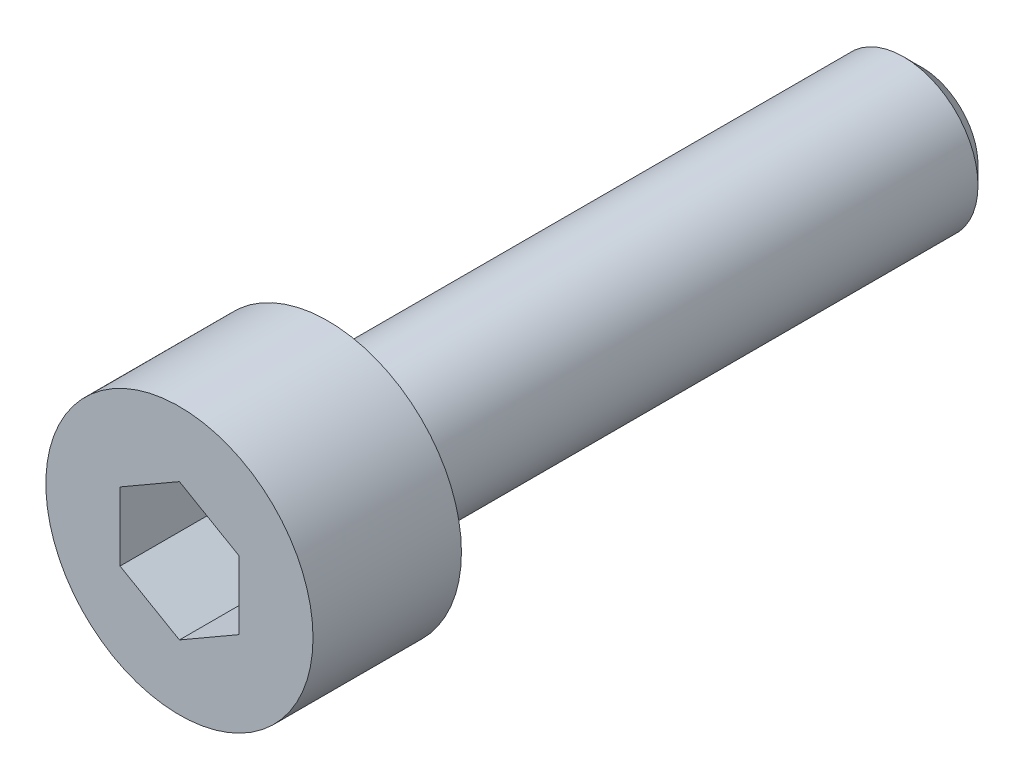
ISO-10303-21;
HEADER;
FILE_DESCRIPTION(('STEP AP214'),'2;1');
FILE_NAME('part.step','',(''),(''),'','','');
FILE_SCHEMA(('AUTOMOTIVE_DESIGN { 1 0 10303 214 1 1 1 1 }'));
ENDSEC;
DATA;
#1=APPLICATION_CONTEXT('core data for automotive mechanical design processes');
#2=APPLICATION_PROTOCOL_DEFINITION('international standard','automotive_design',2000,#1);
#3=PRODUCT_CONTEXT('',#1,'mechanical');
#4=PRODUCT('Part','Part','',(#3));
#5=PRODUCT_RELATED_PRODUCT_CATEGORY('part','',(#4));
#6=PRODUCT_DEFINITION_FORMATION('','',#4);
#7=PRODUCT_DEFINITION_CONTEXT('part definition',#1,'design');
#8=PRODUCT_DEFINITION('design','',#6,#7);
#9=PRODUCT_DEFINITION_SHAPE('','',#8);
#10=(LENGTH_UNIT() NAMED_UNIT(*) SI_UNIT(.MILLI.,.METRE.));
#11=(NAMED_UNIT(*) PLANE_ANGLE_UNIT() SI_UNIT($,.RADIAN.));
#12=(NAMED_UNIT(*) SI_UNIT($,.STERADIAN.) SOLID_ANGLE_UNIT());
#13=UNCERTAINTY_MEASURE_WITH_UNIT(LENGTH_MEASURE(1.E-05),#10,'distance_accuracy_value','');
#14=(GEOMETRIC_REPRESENTATION_CONTEXT(3) GLOBAL_UNCERTAINTY_ASSIGNED_CONTEXT((#13)) GLOBAL_UNIT_ASSIGNED_CONTEXT((#10,
#11,#12)) REPRESENTATION_CONTEXT('',''));
#15=CARTESIAN_POINT('',(0.,0.,0.));
#16=DIRECTION('',(0.,0.,1.));
#17=DIRECTION('',(1.,0.,0.));
#18=AXIS2_PLACEMENT_3D('',#15,#16,#17);
#19=CARTESIAN_POINT('',(0.,0.,0.));
#20=DIRECTION('',(0.,0.,1.));
#21=DIRECTION('',(1.,0.,0.));
#22=AXIS2_PLACEMENT_3D('',#19,#20,#21);
#23=PLANE('',#22);
#24=CARTESIAN_POINT('',(0.,0.,0.));
#25=DIRECTION('',(0.,0.,1.));
#26=DIRECTION('',(1.,0.,0.));
#27=AXIS2_PLACEMENT_3D('',#24,#25,#26);
#28=CIRCLE('',#27,2.25);
#29=CARTESIAN_POINT('',(2.25,0.,0.));
#30=VERTEX_POINT('',#29);
#31=EDGE_CURVE('E137',#30,#30,#28,.T.);
#32=ORIENTED_EDGE('',*,*,#31,.F.);
#33=EDGE_LOOP('',(#32));
#34=FACE_BOUND('',#33,.T.);
#35=CARTESIAN_POINT('',(0.,0.,0.));
#36=DIRECTION('',(0.,0.,1.));
#37=DIRECTION('',(1.,0.,0.));
#38=AXIS2_PLACEMENT_3D('',#35,#36,#37);
#39=CIRCLE('',#38,1.25);
#40=CARTESIAN_POINT('',(1.25,0.,0.));
#41=VERTEX_POINT('',#40);
#42=EDGE_CURVE('E146',#41,#41,#39,.F.);
#43=ORIENTED_EDGE('',*,*,#42,.F.);
#44=EDGE_LOOP('',(#43));
#45=FACE_BOUND('',#44,.T.);
#46=ADVANCED_FACE('F35',(#34,#45),#23,.F.);
#47=CARTESIAN_POINT('',(0.,0.,2.5));
#48=DIRECTION('',(0.,0.,-1.));
#49=DIRECTION('',(-1.,0.,0.));
#50=AXIS2_PLACEMENT_3D('',#47,#48,#49);
#51=CYLINDRICAL_SURFACE('',#50,2.25);
#52=CARTESIAN_POINT('',(0.,0.,2.5));
#53=DIRECTION('',(0.,0.,1.));
#54=DIRECTION('',(1.,0.,0.));
#55=AXIS2_PLACEMENT_3D('',#52,#53,#54);
#56=CIRCLE('',#55,2.25);
#57=CARTESIAN_POINT('',(2.25,0.,2.5));
#58=VERTEX_POINT('',#57);
#59=EDGE_CURVE('E143',#58,#58,#56,.T.);
#60=ORIENTED_EDGE('',*,*,#59,.F.);
#61=EDGE_LOOP('',(#60));
#62=FACE_BOUND('',#61,.T.);
#63=ORIENTED_EDGE('',*,*,#31,.T.);
#64=EDGE_LOOP('',(#63));
#65=FACE_BOUND('',#64,.T.);
#66=ADVANCED_FACE('F168',(#62,#65),#51,.T.);
#67=CARTESIAN_POINT('',(0.,0.,2.5));
#68=DIRECTION('',(0.,0.,1.));
#69=DIRECTION('',(1.,0.,0.));
#70=AXIS2_PLACEMENT_3D('',#67,#68,#69);
#71=PLANE('',#70);
#72=DIRECTION('',(-0.866025403784439,0.5,0.));
#73=VECTOR('',#72,1.);
#74=CARTESIAN_POINT('',(0.999999999999999,0.577350269189626,2.5));
#75=LINE('',#74,#73);
#76=CARTESIAN_POINT('',(0.999999999999999,0.577350269189626,2.5));
#77=VERTEX_POINT('',#76);
#78=CARTESIAN_POINT('',(0.,1.15470053837925,2.5));
#79=VERTEX_POINT('',#78);
#80=EDGE_CURVE('E50',#77,#79,#75,.T.);
#81=ORIENTED_EDGE('',*,*,#80,.F.);
#82=DIRECTION('',(0.,1.,0.));
#83=VECTOR('',#82,1.);
#84=CARTESIAN_POINT('',(0.999999999999999,-0.577350269189626,2.5));
#85=LINE('',#84,#83);
#86=CARTESIAN_POINT('',(0.999999999999999,-0.577350269189626,2.5));
#87=VERTEX_POINT('',#86);
#88=EDGE_CURVE('E133',#87,#77,#85,.T.);
#89=ORIENTED_EDGE('',*,*,#88,.F.);
#90=DIRECTION('',(0.866025403784439,0.5,0.));
#91=VECTOR('',#90,1.);
#92=CARTESIAN_POINT('',(0.,-1.15470053837925,2.5));
#93=LINE('',#92,#91);
#94=CARTESIAN_POINT('',(0.,-1.15470053837925,2.5));
#95=VERTEX_POINT('',#94);
#96=EDGE_CURVE('E131',#95,#87,#93,.T.);
#97=ORIENTED_EDGE('',*,*,#96,.F.);
#98=DIRECTION('',(0.866025403784438,-0.5,0.));
#99=VECTOR('',#98,1.);
#100=CARTESIAN_POINT('',(-1.,-0.577350269189626,2.5));
#101=LINE('',#100,#99);
#102=CARTESIAN_POINT('',(-1.,-0.577350269189626,2.5));
#103=VERTEX_POINT('',#102);
#104=EDGE_CURVE('E98',#103,#95,#101,.T.);
#105=ORIENTED_EDGE('',*,*,#104,.F.);
#106=DIRECTION('',(0.,-1.,0.));
#107=VECTOR('',#106,1.);
#108=CARTESIAN_POINT('',(-1.,0.577350269189626,2.5));
#109=LINE('',#108,#107);
#110=CARTESIAN_POINT('',(-1.,0.577350269189626,2.5));
#111=VERTEX_POINT('',#110);
#112=EDGE_CURVE('E127',#111,#103,#109,.T.);
#113=ORIENTED_EDGE('',*,*,#112,.F.);
#114=DIRECTION('',(-0.866025403784439,-0.5,0.));
#115=VECTOR('',#114,1.);
#116=CARTESIAN_POINT('',(0.,1.15470053837925,2.5));
#117=LINE('',#116,#115);
#118=EDGE_CURVE('E124',#79,#111,#117,.T.);
#119=ORIENTED_EDGE('',*,*,#118,.F.);
#120=EDGE_LOOP('',(#81,#89,#97,#105,#113,#119));
#121=FACE_BOUND('',#120,.T.);
#122=ORIENTED_EDGE('',*,*,#59,.T.);
#123=EDGE_LOOP('',(#122));
#124=FACE_BOUND('',#123,.T.);
#125=ADVANCED_FACE('F174',(#121,#124),#71,.T.);
#126=CARTESIAN_POINT('',(0.,0.,-10.));
#127=DIRECTION('',(0.,0.,1.));
#128=DIRECTION('',(1.,0.,0.));
#129=AXIS2_PLACEMENT_3D('',#126,#127,#128);
#130=CYLINDRICAL_SURFACE('',#129,1.25);
#131=CARTESIAN_POINT('',(0.,0.,-9.7));
#132=DIRECTION('',(0.,0.,-1.));
#133=DIRECTION('',(-1.,0.,0.));
#134=AXIS2_PLACEMENT_3D('',#131,#132,#133);
#135=CIRCLE('',#134,1.25);
#136=CARTESIAN_POINT('',(-1.25,0.,-9.7));
#137=VERTEX_POINT('',#136);
#138=EDGE_CURVE('E11',#137,#137,#135,.F.);
#139=ORIENTED_EDGE('',*,*,#138,.T.);
#140=EDGE_LOOP('',(#139));
#141=FACE_BOUND('',#140,.T.);
#142=ORIENTED_EDGE('',*,*,#42,.T.);
#143=EDGE_LOOP('',(#142));
#144=FACE_BOUND('',#143,.T.);
#145=ADVANCED_FACE('F164',(#141,#144),#130,.T.);
#146=CARTESIAN_POINT('',(0.,0.,-10.));
#147=DIRECTION('',(0.,0.,-1.));
#148=DIRECTION('',(-1.,0.,0.));
#149=AXIS2_PLACEMENT_3D('',#146,#147,#148);
#150=PLANE('',#149);
#151=CARTESIAN_POINT('',(0.,0.,-10.));
#152=DIRECTION('',(0.,0.,-1.));
#153=DIRECTION('',(-1.,0.,0.));
#154=AXIS2_PLACEMENT_3D('',#151,#152,#153);
#155=CIRCLE('',#154,0.950000000000001);
#156=CARTESIAN_POINT('',(-0.950000000000001,0.,-10.));
#157=VERTEX_POINT('',#156);
#158=EDGE_CURVE('E43',#157,#157,#155,.T.);
#159=ORIENTED_EDGE('',*,*,#158,.T.);
#160=EDGE_LOOP('',(#159));
#161=FACE_BOUND('',#160,.T.);
#162=ADVANCED_FACE('F153',(#161),#150,.T.);
#163=CARTESIAN_POINT('',(0.,0.,-10.));
#164=DIRECTION('',(0.,0.,1.));
#165=DIRECTION('',(1.,0.,0.));
#166=AXIS2_PLACEMENT_3D('',#163,#164,#165);
#167=CONICAL_SURFACE('',#166,0.950000000000001,0.785398163397449);
#168=ORIENTED_EDGE('',*,*,#138,.F.);
#169=EDGE_LOOP('',(#168));
#170=FACE_BOUND('',#169,.T.);
#171=ORIENTED_EDGE('',*,*,#158,.F.);
#172=EDGE_LOOP('',(#171));
#173=FACE_BOUND('',#172,.T.);
#174=ADVANCED_FACE('F37',(#170,#173),#167,.T.);
#175=CARTESIAN_POINT('',(0.999999999999999,0.577350269189626,0.5));
#176=DIRECTION('',(0.5,0.866025403784439,0.));
#177=DIRECTION('',(-0.866025403784439,0.5,0.));
#178=AXIS2_PLACEMENT_3D('',#175,#176,#177);
#179=PLANE('',#178);
#180=ORIENTED_EDGE('',*,*,#80,.T.);
#181=DIRECTION('',(0.,0.,1.));
#182=VECTOR('',#181,1.);
#183=CARTESIAN_POINT('',(0.,1.15470053837925,0.5));
#184=LINE('',#183,#182);
#185=CARTESIAN_POINT('',(0.,1.15470053837925,0.5));
#186=VERTEX_POINT('',#185);
#187=EDGE_CURVE('E80',#186,#79,#184,.T.);
#188=ORIENTED_EDGE('',*,*,#187,.F.);
#189=DIRECTION('',(-0.866025403784439,0.5,0.));
#190=VECTOR('',#189,1.);
#191=CARTESIAN_POINT('',(0.999999999999999,0.577350269189626,0.5));
#192=LINE('',#191,#190);
#193=CARTESIAN_POINT('',(0.999999999999999,0.577350269189626,0.5));
#194=VERTEX_POINT('',#193);
#195=EDGE_CURVE('E135',#194,#186,#192,.T.);
#196=ORIENTED_EDGE('',*,*,#195,.F.);
#197=DIRECTION('',(0.,0.,1.));
#198=VECTOR('',#197,1.);
#199=CARTESIAN_POINT('',(0.999999999999999,0.577350269189626,0.5));
#200=LINE('',#199,#198);
#201=EDGE_CURVE('E58',#194,#77,#200,.T.);
#202=ORIENTED_EDGE('',*,*,#201,.T.);
#203=EDGE_LOOP('',(#180,#188,#196,#202));
#204=FACE_BOUND('',#203,.T.);
#205=ADVANCED_FACE('F156',(#204),#179,.F.);
#206=CARTESIAN_POINT('',(0.999999999999999,-0.577350269189626,0.5));
#207=DIRECTION('',(1.,0.,0.));
#208=DIRECTION('',(0.,1.,0.));
#209=AXIS2_PLACEMENT_3D('',#206,#207,#208);
#210=PLANE('',#209);
#211=ORIENTED_EDGE('',*,*,#88,.T.);
#212=ORIENTED_EDGE('',*,*,#201,.F.);
#213=DIRECTION('',(0.,1.,0.));
#214=VECTOR('',#213,1.);
#215=CARTESIAN_POINT('',(0.999999999999999,-0.577350269189626,0.5));
#216=LINE('',#215,#214);
#217=CARTESIAN_POINT('',(0.999999999999999,-0.577350269189626,0.5));
#218=VERTEX_POINT('',#217);
#219=EDGE_CURVE('E110',#218,#194,#216,.T.);
#220=ORIENTED_EDGE('',*,*,#219,.F.);
#221=DIRECTION('',(0.,0.,1.));
#222=VECTOR('',#221,1.);
#223=CARTESIAN_POINT('',(0.999999999999999,-0.577350269189626,0.5));
#224=LINE('',#223,#222);
#225=EDGE_CURVE('E102',#218,#87,#224,.T.);
#226=ORIENTED_EDGE('',*,*,#225,.T.);
#227=EDGE_LOOP('',(#211,#212,#220,#226));
#228=FACE_BOUND('',#227,.T.);
#229=ADVANCED_FACE('F162',(#228),#210,.F.);
#230=CARTESIAN_POINT('',(0.,-1.15470053837925,0.5));
#231=DIRECTION('',(0.5,-0.866025403784439,0.));
#232=DIRECTION('',(0.866025403784439,0.5,0.));
#233=AXIS2_PLACEMENT_3D('',#230,#231,#232);
#234=PLANE('',#233);
#235=ORIENTED_EDGE('',*,*,#96,.T.);
#236=ORIENTED_EDGE('',*,*,#225,.F.);
#237=DIRECTION('',(0.866025403784439,0.5,0.));
#238=VECTOR('',#237,1.);
#239=CARTESIAN_POINT('',(0.,-1.15470053837925,0.5));
#240=LINE('',#239,#238);
#241=CARTESIAN_POINT('',(0.,-1.15470053837925,0.5));
#242=VERTEX_POINT('',#241);
#243=EDGE_CURVE('E106',#242,#218,#240,.T.);
#244=ORIENTED_EDGE('',*,*,#243,.F.);
#245=DIRECTION('',(0.,0.,1.));
#246=VECTOR('',#245,1.);
#247=CARTESIAN_POINT('',(0.,-1.15470053837925,0.5));
#248=LINE('',#247,#246);
#249=EDGE_CURVE('E91',#242,#95,#248,.T.);
#250=ORIENTED_EDGE('',*,*,#249,.T.);
#251=EDGE_LOOP('',(#235,#236,#244,#250));
#252=FACE_BOUND('',#251,.T.);
#253=ADVANCED_FACE('F107',(#252),#234,.F.);
#254=CARTESIAN_POINT('',(-1.,-0.577350269189626,0.5));
#255=DIRECTION('',(-0.5,-0.866025403784439,0.));
#256=DIRECTION('',(0.866025403784438,-0.5,0.));
#257=AXIS2_PLACEMENT_3D('',#254,#255,#256);
#258=PLANE('',#257);
#259=ORIENTED_EDGE('',*,*,#104,.T.);
#260=ORIENTED_EDGE('',*,*,#249,.F.);
#261=DIRECTION('',(0.866025403784438,-0.5,0.));
#262=VECTOR('',#261,1.);
#263=CARTESIAN_POINT('',(-1.,-0.577350269189626,0.5));
#264=LINE('',#263,#262);
#265=CARTESIAN_POINT('',(-1.,-0.577350269189626,0.5));
#266=VERTEX_POINT('',#265);
#267=EDGE_CURVE('E95',#266,#242,#264,.T.);
#268=ORIENTED_EDGE('',*,*,#267,.F.);
#269=DIRECTION('',(0.,0.,1.));
#270=VECTOR('',#269,1.);
#271=CARTESIAN_POINT('',(-1.,-0.577350269189626,0.5));
#272=LINE('',#271,#270);
#273=EDGE_CURVE('E103',#266,#103,#272,.T.);
#274=ORIENTED_EDGE('',*,*,#273,.T.);
#275=EDGE_LOOP('',(#259,#260,#268,#274));
#276=FACE_BOUND('',#275,.T.);
#277=ADVANCED_FACE('F93',(#276),#258,.F.);
#278=CARTESIAN_POINT('',(-1.,0.577350269189626,0.5));
#279=DIRECTION('',(-1.,0.,0.));
#280=DIRECTION('',(0.,0.,1.));
#281=AXIS2_PLACEMENT_3D('',#278,#279,#280);
#282=PLANE('',#281);
#283=ORIENTED_EDGE('',*,*,#112,.T.);
#284=ORIENTED_EDGE('',*,*,#273,.F.);
#285=DIRECTION('',(0.,-1.,0.));
#286=VECTOR('',#285,1.);
#287=CARTESIAN_POINT('',(-1.,0.577350269189626,0.5));
#288=LINE('',#287,#286);
#289=CARTESIAN_POINT('',(-1.,0.577350269189626,0.5));
#290=VERTEX_POINT('',#289);
#291=EDGE_CURVE('E116',#290,#266,#288,.T.);
#292=ORIENTED_EDGE('',*,*,#291,.F.);
#293=DIRECTION('',(0.,0.,1.));
#294=VECTOR('',#293,1.);
#295=CARTESIAN_POINT('',(-1.,0.577350269189626,0.5));
#296=LINE('',#295,#294);
#297=EDGE_CURVE('E140',#290,#111,#296,.T.);
#298=ORIENTED_EDGE('',*,*,#297,.T.);
#299=EDGE_LOOP('',(#283,#284,#292,#298));
#300=FACE_BOUND('',#299,.T.);
#301=ADVANCED_FACE('F188',(#300),#282,.F.);
#302=CARTESIAN_POINT('',(0.,1.15470053837925,0.5));
#303=DIRECTION('',(-0.5,0.866025403784439,0.));
#304=DIRECTION('',(-0.866025403784439,-0.5,0.));
#305=AXIS2_PLACEMENT_3D('',#302,#303,#304);
#306=PLANE('',#305);
#307=ORIENTED_EDGE('',*,*,#118,.T.);
#308=ORIENTED_EDGE('',*,*,#297,.F.);
#309=DIRECTION('',(-0.866025403784439,-0.5,0.));
#310=VECTOR('',#309,1.);
#311=CARTESIAN_POINT('',(0.,1.15470053837925,0.5));
#312=LINE('',#311,#310);
#313=EDGE_CURVE('E118',#186,#290,#312,.T.);
#314=ORIENTED_EDGE('',*,*,#313,.F.);
#315=ORIENTED_EDGE('',*,*,#187,.T.);
#316=EDGE_LOOP('',(#307,#308,#314,#315));
#317=FACE_BOUND('',#316,.T.);
#318=ADVANCED_FACE('F185',(#317),#306,.F.);
#319=CARTESIAN_POINT('',(0.,0.,0.5));
#320=DIRECTION('',(0.,0.,1.));
#321=DIRECTION('',(1.,0.,0.));
#322=AXIS2_PLACEMENT_3D('',#319,#320,#321);
#323=PLANE('',#322);
#324=ORIENTED_EDGE('',*,*,#195,.T.);
#325=ORIENTED_EDGE('',*,*,#313,.T.);
#326=ORIENTED_EDGE('',*,*,#291,.T.);
#327=ORIENTED_EDGE('',*,*,#267,.T.);
#328=ORIENTED_EDGE('',*,*,#243,.T.);
#329=ORIENTED_EDGE('',*,*,#219,.T.);
#330=EDGE_LOOP('',(#324,#325,#326,#327,#328,#329));
#331=FACE_BOUND('',#330,.T.);
#332=ADVANCED_FACE('F113',(#331),#323,.T.);
#333=CLOSED_SHELL('',(#46,#66,#125,#145,#162,#174,#205,#229,#253,#277,#301,#318,#332));
#334=MANIFOLD_SOLID_BREP('B2',#333);
#335=ADVANCED_BREP_SHAPE_REPRESENTATION('',(#18,#334),#14);
#336=SHAPE_DEFINITION_REPRESENTATION(#9,#335);
ENDSEC;
END-ISO-10303-21;
